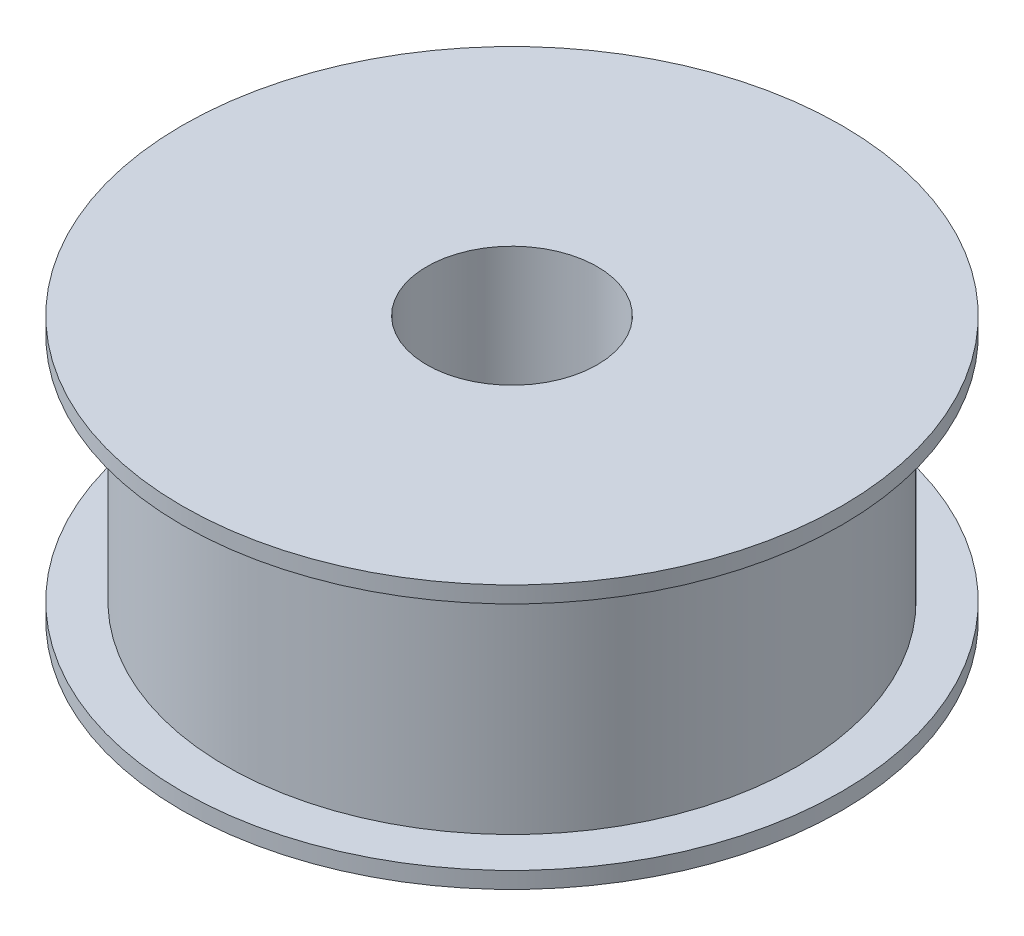
ISO-10303-21;
HEADER;
FILE_DESCRIPTION(('STEP AP214'),'2;1');
FILE_NAME('part.step','',(''),(''),'','','');
FILE_SCHEMA(('AUTOMOTIVE_DESIGN { 1 0 10303 214 1 1 1 1 }'));
ENDSEC;
DATA;
#1=APPLICATION_CONTEXT('core data for automotive mechanical design processes');
#2=APPLICATION_PROTOCOL_DEFINITION('international standard','automotive_design',2000,#1);
#3=PRODUCT_CONTEXT('',#1,'mechanical');
#4=PRODUCT('Part','Part','',(#3));
#5=PRODUCT_RELATED_PRODUCT_CATEGORY('part','',(#4));
#6=PRODUCT_DEFINITION_FORMATION('','',#4);
#7=PRODUCT_DEFINITION_CONTEXT('part definition',#1,'design');
#8=PRODUCT_DEFINITION('design','',#6,#7);
#9=PRODUCT_DEFINITION_SHAPE('','',#8);
#10=(LENGTH_UNIT() NAMED_UNIT(*) SI_UNIT(.MILLI.,.METRE.));
#11=(NAMED_UNIT(*) PLANE_ANGLE_UNIT() SI_UNIT($,.RADIAN.));
#12=(NAMED_UNIT(*) SI_UNIT($,.STERADIAN.) SOLID_ANGLE_UNIT());
#13=UNCERTAINTY_MEASURE_WITH_UNIT(LENGTH_MEASURE(1.E-05),#10,'distance_accuracy_value','');
#14=(GEOMETRIC_REPRESENTATION_CONTEXT(3) GLOBAL_UNCERTAINTY_ASSIGNED_CONTEXT((#13)) GLOBAL_UNIT_ASSIGNED_CONTEXT((#10,
#11,#12)) REPRESENTATION_CONTEXT('',''));
#15=CARTESIAN_POINT('',(0.,0.,0.));
#16=DIRECTION('',(0.,0.,1.));
#17=DIRECTION('',(1.,0.,0.));
#18=AXIS2_PLACEMENT_3D('',#15,#16,#17);
#19=CARTESIAN_POINT('',(1.79436658782568E-12,-523.100972672403,0.));
#20=DIRECTION('',(0.,-1.,0.));
#21=DIRECTION('',(1.,0.,0.));
#22=AXIS2_PLACEMENT_3D('',#19,#20,#21);
#23=CYLINDRICAL_SURFACE('',#22,15.5);
#24=CARTESIAN_POINT('',(0.,-24.0000000000001,0.));
#25=DIRECTION('',(0.,-1.,0.));
#26=DIRECTION('',(1.,0.,0.));
#27=AXIS2_PLACEMENT_3D('',#24,#25,#26);
#28=CIRCLE('',#27,15.4999999999999);
#29=CARTESIAN_POINT('',(15.5,-24.,0.));
#30=VERTEX_POINT('',#29);
#31=EDGE_CURVE('E10',#30,#30,#28,.T.);
#32=ORIENTED_EDGE('',*,*,#31,.T.);
#33=EDGE_LOOP('',(#32));
#34=FACE_BOUND('',#33,.T.);
#35=CARTESIAN_POINT('',(0.,24.,0.));
#36=DIRECTION('',(0.,-1.,0.));
#37=DIRECTION('',(1.,0.,0.));
#38=AXIS2_PLACEMENT_3D('',#35,#36,#37);
#39=CIRCLE('',#38,15.5000000000001);
#40=CARTESIAN_POINT('',(15.5,24.0000000000001,0.));
#41=VERTEX_POINT('',#40);
#42=EDGE_CURVE('E65',#41,#41,#39,.T.);
#43=ORIENTED_EDGE('',*,*,#42,.F.);
#44=EDGE_LOOP('',(#43));
#45=FACE_BOUND('',#44,.T.);
#46=ADVANCED_FACE('F37',(#34,#45),#23,.F.);
#47=CARTESIAN_POINT('',(15.5,-24.0000000000001,0.));
#48=DIRECTION('',(0.,-1.,0.));
#49=DIRECTION('',(1.,0.,0.));
#50=AXIS2_PLACEMENT_3D('',#47,#48,#49);
#51=PLANE('',#50);
#52=CARTESIAN_POINT('',(0.,-24.0000000000002,0.));
#53=DIRECTION('',(0.,-1.,0.));
#54=DIRECTION('',(1.,0.,0.));
#55=AXIS2_PLACEMENT_3D('',#52,#53,#54);
#56=CIRCLE('',#55,59.9999999999999);
#57=CARTESIAN_POINT('',(60.,-24.,0.));
#58=VERTEX_POINT('',#57);
#59=EDGE_CURVE('E43',#58,#58,#56,.T.);
#60=ORIENTED_EDGE('',*,*,#59,.T.);
#61=EDGE_LOOP('',(#60));
#62=FACE_BOUND('',#61,.T.);
#63=ORIENTED_EDGE('',*,*,#31,.F.);
#64=EDGE_LOOP('',(#63));
#65=FACE_BOUND('',#64,.T.);
#66=ADVANCED_FACE('F72',(#62,#65),#51,.T.);
#67=CARTESIAN_POINT('',(1.79436658782568E-12,-523.100972672403,0.));
#68=DIRECTION('',(0.,-1.,0.));
#69=DIRECTION('',(1.,0.,0.));
#70=AXIS2_PLACEMENT_3D('',#67,#68,#69);
#71=CYLINDRICAL_SURFACE('',#70,59.9999999999999);
#72=CARTESIAN_POINT('',(0.,-21.0000000000002,0.));
#73=DIRECTION('',(0.,-1.,0.));
#74=DIRECTION('',(1.,0.,0.));
#75=AXIS2_PLACEMENT_3D('',#72,#73,#74);
#76=CIRCLE('',#75,59.9999999999999);
#77=CARTESIAN_POINT('',(60.,-21.,0.));
#78=VERTEX_POINT('',#77);
#79=EDGE_CURVE('E47',#78,#78,#76,.T.);
#80=ORIENTED_EDGE('',*,*,#79,.T.);
#81=EDGE_LOOP('',(#80));
#82=FACE_BOUND('',#81,.T.);
#83=ORIENTED_EDGE('',*,*,#59,.F.);
#84=EDGE_LOOP('',(#83));
#85=FACE_BOUND('',#84,.T.);
#86=ADVANCED_FACE('F76',(#82,#85),#71,.T.);
#87=CARTESIAN_POINT('',(60.,-21.,0.));
#88=DIRECTION('',(0.,1.,0.));
#89=DIRECTION('',(-1.,0.,0.));
#90=AXIS2_PLACEMENT_3D('',#87,#88,#89);
#91=PLANE('',#90);
#92=CARTESIAN_POINT('',(0.,-21.0000000000002,0.));
#93=DIRECTION('',(0.,-1.,0.));
#94=DIRECTION('',(1.,0.,0.));
#95=AXIS2_PLACEMENT_3D('',#92,#93,#94);
#96=CIRCLE('',#95,51.9999999999999);
#97=CARTESIAN_POINT('',(52.,-21.0000000000001,0.));
#98=VERTEX_POINT('',#97);
#99=EDGE_CURVE('E51',#98,#98,#96,.T.);
#100=ORIENTED_EDGE('',*,*,#99,.T.);
#101=EDGE_LOOP('',(#100));
#102=FACE_BOUND('',#101,.T.);
#103=ORIENTED_EDGE('',*,*,#79,.F.);
#104=EDGE_LOOP('',(#103));
#105=FACE_BOUND('',#104,.T.);
#106=ADVANCED_FACE('F80',(#102,#105),#91,.T.);
#107=CARTESIAN_POINT('',(1.79436658782568E-12,-523.100972672403,0.));
#108=DIRECTION('',(0.,-1.,0.));
#109=DIRECTION('',(1.,0.,0.));
#110=AXIS2_PLACEMENT_3D('',#107,#108,#109);
#111=CYLINDRICAL_SURFACE('',#110,52.);
#112=CARTESIAN_POINT('',(0.,20.9999999999998,0.));
#113=DIRECTION('',(0.,-1.,0.));
#114=DIRECTION('',(1.,0.,0.));
#115=AXIS2_PLACEMENT_3D('',#112,#113,#114);
#116=CIRCLE('',#115,52.0000000000001);
#117=CARTESIAN_POINT('',(52.,21.,0.));
#118=VERTEX_POINT('',#117);
#119=EDGE_CURVE('E56',#118,#118,#116,.T.);
#120=ORIENTED_EDGE('',*,*,#119,.T.);
#121=EDGE_LOOP('',(#120));
#122=FACE_BOUND('',#121,.T.);
#123=ORIENTED_EDGE('',*,*,#99,.F.);
#124=EDGE_LOOP('',(#123));
#125=FACE_BOUND('',#124,.T.);
#126=ADVANCED_FACE('F87',(#122,#125),#111,.T.);
#127=CARTESIAN_POINT('',(60.,21.,0.));
#128=DIRECTION('',(0.,1.,0.));
#129=DIRECTION('',(-1.,0.,0.));
#130=AXIS2_PLACEMENT_3D('',#127,#128,#129);
#131=PLANE('',#130);
#132=ORIENTED_EDGE('',*,*,#119,.F.);
#133=EDGE_LOOP('',(#132));
#134=FACE_BOUND('',#133,.T.);
#135=CARTESIAN_POINT('',(0.,20.9999999999998,0.));
#136=DIRECTION('',(0.,-1.,0.));
#137=DIRECTION('',(1.,0.,0.));
#138=AXIS2_PLACEMENT_3D('',#135,#136,#137);
#139=CIRCLE('',#138,60.0000000000001);
#140=CARTESIAN_POINT('',(60.,21.,0.));
#141=VERTEX_POINT('',#140);
#142=EDGE_CURVE('E59',#141,#141,#139,.T.);
#143=ORIENTED_EDGE('',*,*,#142,.T.);
#144=EDGE_LOOP('',(#143));
#145=FACE_BOUND('',#144,.T.);
#146=ADVANCED_FACE('F91',(#134,#145),#131,.F.);
#147=CARTESIAN_POINT('',(1.79436658782568E-12,-523.100972672403,0.));
#148=DIRECTION('',(0.,-1.,0.));
#149=DIRECTION('',(1.,0.,0.));
#150=AXIS2_PLACEMENT_3D('',#147,#148,#149);
#151=CYLINDRICAL_SURFACE('',#150,60.0000000000001);
#152=ORIENTED_EDGE('',*,*,#142,.F.);
#153=EDGE_LOOP('',(#152));
#154=FACE_BOUND('',#153,.T.);
#155=CARTESIAN_POINT('',(0.,23.9999999999998,0.));
#156=DIRECTION('',(0.,-1.,0.));
#157=DIRECTION('',(1.,0.,0.));
#158=AXIS2_PLACEMENT_3D('',#155,#156,#157);
#159=CIRCLE('',#158,60.0000000000001);
#160=CARTESIAN_POINT('',(60.,24.,0.));
#161=VERTEX_POINT('',#160);
#162=EDGE_CURVE('E62',#161,#161,#159,.T.);
#163=ORIENTED_EDGE('',*,*,#162,.T.);
#164=EDGE_LOOP('',(#163));
#165=FACE_BOUND('',#164,.T.);
#166=ADVANCED_FACE('F95',(#154,#165),#151,.T.);
#167=CARTESIAN_POINT('',(15.5,23.9999999999999,0.));
#168=DIRECTION('',(0.,-1.,0.));
#169=DIRECTION('',(1.,0.,0.));
#170=AXIS2_PLACEMENT_3D('',#167,#168,#169);
#171=PLANE('',#170);
#172=ORIENTED_EDGE('',*,*,#162,.F.);
#173=EDGE_LOOP('',(#172));
#174=FACE_BOUND('',#173,.T.);
#175=ORIENTED_EDGE('',*,*,#42,.T.);
#176=EDGE_LOOP('',(#175));
#177=FACE_BOUND('',#176,.T.);
#178=ADVANCED_FACE('F69',(#174,#177),#171,.F.);
#179=CLOSED_SHELL('',(#46,#66,#86,#106,#126,#146,#166,#178));
#180=MANIFOLD_SOLID_BREP('B2',#179);
#181=ADVANCED_BREP_SHAPE_REPRESENTATION('',(#18,#180),#14);
#182=SHAPE_DEFINITION_REPRESENTATION(#9,#181);
ENDSEC;
END-ISO-10303-21;
